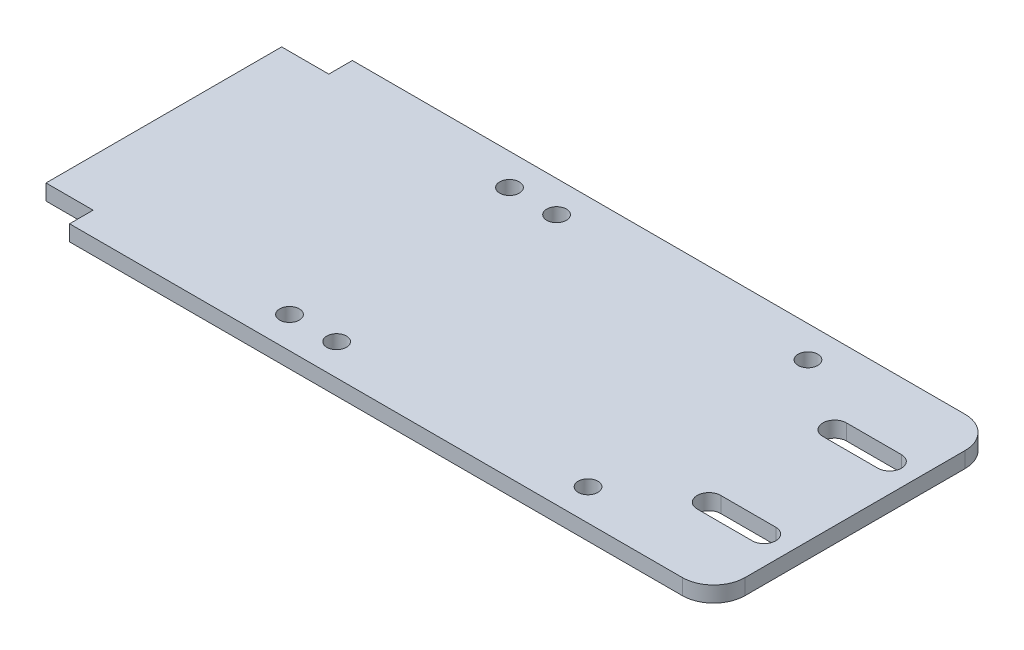
ISO-10303-21;
HEADER;
FILE_DESCRIPTION(('STEP AP214'),'2;1');
FILE_NAME('part.step','',(''),(''),'','','');
FILE_SCHEMA(('AUTOMOTIVE_DESIGN { 1 0 10303 214 1 1 1 1 }'));
ENDSEC;
DATA;
#1=APPLICATION_CONTEXT('core data for automotive mechanical design processes');
#2=APPLICATION_PROTOCOL_DEFINITION('international standard','automotive_design',2000,#1);
#3=PRODUCT_CONTEXT('',#1,'mechanical');
#4=PRODUCT('Part','Part','',(#3));
#5=PRODUCT_RELATED_PRODUCT_CATEGORY('part','',(#4));
#6=PRODUCT_DEFINITION_FORMATION('','',#4);
#7=PRODUCT_DEFINITION_CONTEXT('part definition',#1,'design');
#8=PRODUCT_DEFINITION('design','',#6,#7);
#9=PRODUCT_DEFINITION_SHAPE('','',#8);
#10=(LENGTH_UNIT() NAMED_UNIT(*) SI_UNIT(.MILLI.,.METRE.));
#11=(NAMED_UNIT(*) PLANE_ANGLE_UNIT() SI_UNIT($,.RADIAN.));
#12=(NAMED_UNIT(*) SI_UNIT($,.STERADIAN.) SOLID_ANGLE_UNIT());
#13=UNCERTAINTY_MEASURE_WITH_UNIT(LENGTH_MEASURE(1.E-05),#10,'distance_accuracy_value','');
#14=(GEOMETRIC_REPRESENTATION_CONTEXT(3) GLOBAL_UNCERTAINTY_ASSIGNED_CONTEXT((#13)) GLOBAL_UNIT_ASSIGNED_CONTEXT((#10,
#11,#12)) REPRESENTATION_CONTEXT('',''));
#15=CARTESIAN_POINT('',(0.,0.,0.));
#16=DIRECTION('',(0.,0.,1.));
#17=DIRECTION('',(1.,0.,0.));
#18=AXIS2_PLACEMENT_3D('',#15,#16,#17);
#19=CARTESIAN_POINT('',(0.,-10.0000000000001,0.));
#20=DIRECTION('',(0.,-1.,0.));
#21=DIRECTION('',(0.,0.,-1.));
#22=AXIS2_PLACEMENT_3D('',#19,#20,#21);
#23=PLANE('',#22);
#24=DIRECTION('',(0.,0.,-1.));
#25=VECTOR('',#24,1.);
#26=CARTESIAN_POINT('',(-190.,-9.99999999999973,-89.9999999999998));
#27=LINE('',#26,#25);
#28=CARTESIAN_POINT('',(-190.,-9.99999999999976,-74.9999999999998));
#29=VERTEX_POINT('',#28);
#30=CARTESIAN_POINT('',(-190.,-9.99999999999973,-89.9999999999998));
#31=VERTEX_POINT('',#30);
#32=EDGE_CURVE('E179',#29,#31,#27,.T.);
#33=ORIENTED_EDGE('',*,*,#32,.T.);
#34=DIRECTION('',(-1.,0.,0.));
#35=VECTOR('',#34,1.);
#36=CARTESIAN_POINT('',(-220.,-10.,-89.9999999999999));
#37=LINE('',#36,#35);
#38=CARTESIAN_POINT('',(200.,-10.,-89.9999999999999));
#39=VERTEX_POINT('',#38);
#40=EDGE_CURVE('E197',#39,#31,#37,.T.);
#41=ORIENTED_EDGE('',*,*,#40,.F.);
#42=CARTESIAN_POINT('',(200.,-9.99999999999991,-69.9999999999998));
#43=DIRECTION('',(0.,-1.,0.));
#44=DIRECTION('',(0.,0.,-1.));
#45=AXIS2_PLACEMENT_3D('',#42,#43,#44);
#46=CIRCLE('',#45,20.);
#47=CARTESIAN_POINT('',(220.,-9.99999999999993,-69.9999999999999));
#48=VERTEX_POINT('',#47);
#49=EDGE_CURVE('E51',#39,#48,#46,.T.);
#50=ORIENTED_EDGE('',*,*,#49,.T.);
#51=DIRECTION('',(0.,0.,-1.));
#52=VECTOR('',#51,1.);
#53=CARTESIAN_POINT('',(220.,-10.,90.0000000000002));
#54=LINE('',#53,#52);
#55=CARTESIAN_POINT('',(220.,-10.0000000000001,70.0000000000002));
#56=VERTEX_POINT('',#55);
#57=EDGE_CURVE('E205',#56,#48,#54,.T.);
#58=ORIENTED_EDGE('',*,*,#57,.F.);
#59=CARTESIAN_POINT('',(200.,-9.99999999999984,70.0000000000002));
#60=DIRECTION('',(0.,-1.,0.));
#61=DIRECTION('',(0.,0.,-1.));
#62=AXIS2_PLACEMENT_3D('',#59,#60,#61);
#63=CIRCLE('',#62,20.);
#64=CARTESIAN_POINT('',(200.,-10.,90.0000000000002));
#65=VERTEX_POINT('',#64);
#66=EDGE_CURVE('E238',#56,#65,#63,.T.);
#67=ORIENTED_EDGE('',*,*,#66,.T.);
#68=DIRECTION('',(1.,0.,0.));
#69=VECTOR('',#68,1.);
#70=CARTESIAN_POINT('',(-220.,-10.,90.0000000000002));
#71=LINE('',#70,#69);
#72=CARTESIAN_POINT('',(-190.,-9.99999999999988,90.0000000000001));
#73=VERTEX_POINT('',#72);
#74=EDGE_CURVE('E196',#73,#65,#71,.T.);
#75=ORIENTED_EDGE('',*,*,#74,.F.);
#76=DIRECTION('',(0.,0.,-1.));
#77=VECTOR('',#76,1.);
#78=CARTESIAN_POINT('',(-190.,-9.99999999999988,90.0000000000001));
#79=LINE('',#78,#77);
#80=CARTESIAN_POINT('',(-190.,-9.99999999999988,75.));
#81=VERTEX_POINT('',#80);
#82=EDGE_CURVE('E276',#73,#81,#79,.T.);
#83=ORIENTED_EDGE('',*,*,#82,.T.);
#84=DIRECTION('',(-1.,0.,0.));
#85=VECTOR('',#84,1.);
#86=CARTESIAN_POINT('',(-220.,-10.,75.0000000000002));
#87=LINE('',#86,#85);
#88=CARTESIAN_POINT('',(-220.,-10.,75.0000000000002));
#89=VERTEX_POINT('',#88);
#90=EDGE_CURVE('E194',#81,#89,#87,.T.);
#91=ORIENTED_EDGE('',*,*,#90,.T.);
#92=DIRECTION('',(0.,0.,1.));
#93=VECTOR('',#92,1.);
#94=CARTESIAN_POINT('',(-220.,-10.,90.0000000000002));
#95=LINE('',#94,#93);
#96=CARTESIAN_POINT('',(-220.,-10.,-74.9999999999999));
#97=VERTEX_POINT('',#96);
#98=EDGE_CURVE('E185',#97,#89,#95,.T.);
#99=ORIENTED_EDGE('',*,*,#98,.F.);
#100=DIRECTION('',(1.,0.,0.));
#101=VECTOR('',#100,1.);
#102=CARTESIAN_POINT('',(-220.,-10.,-74.9999999999999));
#103=LINE('',#102,#101);
#104=EDGE_CURVE('E167',#97,#29,#103,.T.);
#105=ORIENTED_EDGE('',*,*,#104,.T.);
#106=EDGE_LOOP('',(#33,#41,#50,#58,#67,#75,#83,#91,#99,#105));
#107=FACE_BOUND('',#106,.T.);
#108=CARTESIAN_POINT('',(167.,-9.99999999999995,40.0000000000004));
#109=DIRECTION('',(0.,-1.,0.));
#110=DIRECTION('',(0.,0.,-1.));
#111=AXIS2_PLACEMENT_3D('',#108,#109,#110);
#112=CIRCLE('',#111,7.5);
#113=CARTESIAN_POINT('',(167.,-9.99999999999993,32.5000000000001));
#114=VERTEX_POINT('',#113);
#115=CARTESIAN_POINT('',(167.,-9.99999999999993,47.5000000000004));
#116=VERTEX_POINT('',#115);
#117=EDGE_CURVE('E345',#114,#116,#112,.F.);
#118=ORIENTED_EDGE('',*,*,#117,.T.);
#119=DIRECTION('',(1.,0.,0.));
#120=VECTOR('',#119,1.);
#121=CARTESIAN_POINT('',(167.,-9.99999999999993,47.5000000000004));
#122=LINE('',#121,#120);
#123=CARTESIAN_POINT('',(202.,-9.99999999999986,47.5000000000004));
#124=VERTEX_POINT('',#123);
#125=EDGE_CURVE('E368',#116,#124,#122,.T.);
#126=ORIENTED_EDGE('',*,*,#125,.T.);
#127=CARTESIAN_POINT('',(202.,-9.99999999999987,40.0000000000004));
#128=DIRECTION('',(0.,-1.,0.));
#129=DIRECTION('',(0.,0.,-1.));
#130=AXIS2_PLACEMENT_3D('',#127,#128,#129);
#131=CIRCLE('',#130,7.5);
#132=CARTESIAN_POINT('',(202.,-9.99999999999987,32.5000000000001));
#133=VERTEX_POINT('',#132);
#134=EDGE_CURVE('E337',#124,#133,#131,.F.);
#135=ORIENTED_EDGE('',*,*,#134,.T.);
#136=DIRECTION('',(-1.,0.,0.));
#137=VECTOR('',#136,1.);
#138=CARTESIAN_POINT('',(167.,-9.99999999999993,32.5000000000001));
#139=LINE('',#138,#137);
#140=EDGE_CURVE('E341',#133,#114,#139,.T.);
#141=ORIENTED_EDGE('',*,*,#140,.T.);
#142=EDGE_LOOP('',(#118,#126,#135,#141));
#143=FACE_BOUND('',#142,.T.);
#144=CARTESIAN_POINT('',(-40.,-9.99999999999993,70.0000000000004));
#145=DIRECTION('',(0.,-1.,0.));
#146=DIRECTION('',(0.,0.,-1.));
#147=AXIS2_PLACEMENT_3D('',#144,#145,#146);
#148=CIRCLE('',#147,6.25000000000001);
#149=CARTESIAN_POINT('',(-40.,-9.99999999999993,63.7500000000004));
#150=VERTEX_POINT('',#149);
#151=EDGE_CURVE('E381',#150,#150,#148,.F.);
#152=ORIENTED_EDGE('',*,*,#151,.T.);
#153=EDGE_LOOP('',(#152));
#154=FACE_BOUND('',#153,.T.);
#155=CARTESIAN_POINT('',(-40.,-10.0000000000002,-69.9999999999998));
#156=DIRECTION('',(0.,-1.,0.));
#157=DIRECTION('',(0.,0.,-1.));
#158=AXIS2_PLACEMENT_3D('',#155,#156,#157);
#159=CIRCLE('',#158,6.25000000000001);
#160=CARTESIAN_POINT('',(-40.,-10.0000000000002,-76.2499999999998));
#161=VERTEX_POINT('',#160);
#162=EDGE_CURVE('E386',#161,#161,#159,.F.);
#163=ORIENTED_EDGE('',*,*,#162,.T.);
#164=EDGE_LOOP('',(#163));
#165=FACE_BOUND('',#164,.T.);
#166=CARTESIAN_POINT('',(-70.,-9.99999999999999,-69.9999999999998));
#167=DIRECTION('',(0.,-1.,0.));
#168=DIRECTION('',(0.,0.,-1.));
#169=AXIS2_PLACEMENT_3D('',#166,#167,#168);
#170=CIRCLE('',#169,6.25);
#171=CARTESIAN_POINT('',(-70.,-9.99999999999999,-76.2499999999998));
#172=VERTEX_POINT('',#171);
#173=EDGE_CURVE('E411',#172,#172,#170,.F.);
#174=ORIENTED_EDGE('',*,*,#173,.T.);
#175=EDGE_LOOP('',(#174));
#176=FACE_BOUND('',#175,.T.);
#177=CARTESIAN_POINT('',(120.,-9.99999999999983,70.0000000000002));
#178=DIRECTION('',(0.,-1.,0.));
#179=DIRECTION('',(0.,0.,-1.));
#180=AXIS2_PLACEMENT_3D('',#177,#178,#179);
#181=CIRCLE('',#180,6.25);
#182=CARTESIAN_POINT('',(120.,-9.99999999999983,63.7500000000002));
#183=VERTEX_POINT('',#182);
#184=EDGE_CURVE('E402',#183,#183,#181,.F.);
#185=ORIENTED_EDGE('',*,*,#184,.T.);
#186=EDGE_LOOP('',(#185));
#187=FACE_BOUND('',#186,.T.);
#188=CARTESIAN_POINT('',(-69.9999999999999,-9.99999999999984,70.0000000000003));
#189=DIRECTION('',(0.,-1.,0.));
#190=DIRECTION('',(0.,0.,-1.));
#191=AXIS2_PLACEMENT_3D('',#188,#189,#190);
#192=CIRCLE('',#191,6.25);
#193=CARTESIAN_POINT('',(-69.9999999999999,-9.99999999999984,63.7500000000002));
#194=VERTEX_POINT('',#193);
#195=EDGE_CURVE('E394',#194,#194,#192,.F.);
#196=ORIENTED_EDGE('',*,*,#195,.T.);
#197=EDGE_LOOP('',(#196));
#198=FACE_BOUND('',#197,.T.);
#199=CARTESIAN_POINT('',(120.,-9.99999999999987,-70.));
#200=DIRECTION('',(0.,-1.,0.));
#201=DIRECTION('',(0.,0.,-1.));
#202=AXIS2_PLACEMENT_3D('',#199,#200,#201);
#203=CIRCLE('',#202,6.25);
#204=CARTESIAN_POINT('',(120.,-9.99999999999987,-76.25));
#205=VERTEX_POINT('',#204);
#206=EDGE_CURVE('E410',#205,#205,#203,.F.);
#207=ORIENTED_EDGE('',*,*,#206,.T.);
#208=EDGE_LOOP('',(#207));
#209=FACE_BOUND('',#208,.T.);
#210=DIRECTION('',(1.,0.,0.));
#211=VECTOR('',#210,1.);
#212=CARTESIAN_POINT('',(167.,-10.0000000000001,-47.5));
#213=LINE('',#212,#211);
#214=CARTESIAN_POINT('',(167.,-10.0000000000001,-47.5));
#215=VERTEX_POINT('',#214);
#216=CARTESIAN_POINT('',(202.,-9.99999999999991,-47.5));
#217=VERTEX_POINT('',#216);
#218=EDGE_CURVE('E269',#215,#217,#213,.T.);
#219=ORIENTED_EDGE('',*,*,#218,.F.);
#220=CARTESIAN_POINT('',(167.,-10.,-40.));
#221=DIRECTION('',(0.,-1.,0.));
#222=DIRECTION('',(0.,0.,-1.));
#223=AXIS2_PLACEMENT_3D('',#220,#221,#222);
#224=CIRCLE('',#223,7.5);
#225=CARTESIAN_POINT('',(167.,-10.0000000000001,-32.5));
#226=VERTEX_POINT('',#225);
#227=EDGE_CURVE('E300',#226,#215,#224,.T.);
#228=ORIENTED_EDGE('',*,*,#227,.F.);
#229=DIRECTION('',(-1.,0.,0.));
#230=VECTOR('',#229,1.);
#231=CARTESIAN_POINT('',(167.,-10.0000000000001,-32.5));
#232=LINE('',#231,#230);
#233=CARTESIAN_POINT('',(202.,-9.9999999999998,-32.4999999999999));
#234=VERTEX_POINT('',#233);
#235=EDGE_CURVE('E324',#234,#226,#232,.T.);
#236=ORIENTED_EDGE('',*,*,#235,.F.);
#237=CARTESIAN_POINT('',(202.,-9.99999999999991,-40.));
#238=DIRECTION('',(0.,-1.,0.));
#239=DIRECTION('',(0.,0.,-1.));
#240=AXIS2_PLACEMENT_3D('',#237,#238,#239);
#241=CIRCLE('',#240,7.5);
#242=EDGE_CURVE('E265',#217,#234,#241,.T.);
#243=ORIENTED_EDGE('',*,*,#242,.F.);
#244=EDGE_LOOP('',(#219,#228,#236,#243));
#245=FACE_BOUND('',#244,.T.);
#246=ADVANCED_FACE('F42',(#107,#143,#154,#165,#176,#187,#198,#209,#245),#23,.T.);
#247=CARTESIAN_POINT('',(0.,0.,0.));
#248=DIRECTION('',(0.,-1.,0.));
#249=DIRECTION('',(0.,0.,-1.));
#250=AXIS2_PLACEMENT_3D('',#247,#248,#249);
#251=PLANE('',#250);
#252=DIRECTION('',(-1.,0.,0.));
#253=VECTOR('',#252,1.);
#254=CARTESIAN_POINT('',(-220.,0.,-89.9999999999999));
#255=LINE('',#254,#253);
#256=CARTESIAN_POINT('',(200.,0.,-89.9999999999998));
#257=VERTEX_POINT('',#256);
#258=CARTESIAN_POINT('',(-190.,0.,-89.9999999999999));
#259=VERTEX_POINT('',#258);
#260=EDGE_CURVE('E213',#257,#259,#255,.T.);
#261=ORIENTED_EDGE('',*,*,#260,.T.);
#262=DIRECTION('',(0.,0.,-1.));
#263=VECTOR('',#262,1.);
#264=CARTESIAN_POINT('',(-190.,0.,-89.9999999999999));
#265=LINE('',#264,#263);
#266=CARTESIAN_POINT('',(-190.,1.66533453693773E-13,-74.9999999999999));
#267=VERTEX_POINT('',#266);
#268=EDGE_CURVE('E66',#267,#259,#265,.T.);
#269=ORIENTED_EDGE('',*,*,#268,.F.);
#270=DIRECTION('',(1.,0.,0.));
#271=VECTOR('',#270,1.);
#272=CARTESIAN_POINT('',(-220.,1.66533453693773E-13,-74.9999999999999));
#273=LINE('',#272,#271);
#274=CARTESIAN_POINT('',(-220.,1.66533453693773E-13,-74.9999999999999));
#275=VERTEX_POINT('',#274);
#276=EDGE_CURVE('E291',#275,#267,#273,.T.);
#277=ORIENTED_EDGE('',*,*,#276,.F.);
#278=DIRECTION('',(0.,0.,1.));
#279=VECTOR('',#278,1.);
#280=CARTESIAN_POINT('',(-219.999999999999,0.,90.0000000000002));
#281=LINE('',#280,#279);
#282=CARTESIAN_POINT('',(-219.999999999999,0.,75.0000000000002));
#283=VERTEX_POINT('',#282);
#284=EDGE_CURVE('E187',#275,#283,#281,.T.);
#285=ORIENTED_EDGE('',*,*,#284,.T.);
#286=DIRECTION('',(-1.,0.,0.));
#287=VECTOR('',#286,1.);
#288=CARTESIAN_POINT('',(-219.999999999999,0.,75.0000000000002));
#289=LINE('',#288,#287);
#290=CARTESIAN_POINT('',(-190.,0.,75.0000000000002));
#291=VERTEX_POINT('',#290);
#292=EDGE_CURVE('E58',#291,#283,#289,.T.);
#293=ORIENTED_EDGE('',*,*,#292,.F.);
#294=DIRECTION('',(0.,0.,-1.));
#295=VECTOR('',#294,1.);
#296=CARTESIAN_POINT('',(-190.,0.,90.0000000000002));
#297=LINE('',#296,#295);
#298=CARTESIAN_POINT('',(-190.,0.,90.0000000000002));
#299=VERTEX_POINT('',#298);
#300=EDGE_CURVE('E282',#299,#291,#297,.T.);
#301=ORIENTED_EDGE('',*,*,#300,.F.);
#302=DIRECTION('',(1.,0.,0.));
#303=VECTOR('',#302,1.);
#304=CARTESIAN_POINT('',(-219.999999999999,0.,90.0000000000002));
#305=LINE('',#304,#303);
#306=CARTESIAN_POINT('',(200.,0.,90.0000000000002));
#307=VERTEX_POINT('',#306);
#308=EDGE_CURVE('E220',#299,#307,#305,.T.);
#309=ORIENTED_EDGE('',*,*,#308,.T.);
#310=CARTESIAN_POINT('',(200.,0.,70.0000000000002));
#311=DIRECTION('',(0.,-1.,0.));
#312=DIRECTION('',(0.,0.,-1.));
#313=AXIS2_PLACEMENT_3D('',#310,#311,#312);
#314=CIRCLE('',#313,20.);
#315=CARTESIAN_POINT('',(220.,0.,70.0000000000002));
#316=VERTEX_POINT('',#315);
#317=EDGE_CURVE('E229',#307,#316,#314,.F.);
#318=ORIENTED_EDGE('',*,*,#317,.T.);
#319=DIRECTION('',(0.,0.,-1.));
#320=VECTOR('',#319,1.);
#321=CARTESIAN_POINT('',(220.,0.,90.0000000000002));
#322=LINE('',#321,#320);
#323=CARTESIAN_POINT('',(220.,0.,-69.9999999999999));
#324=VERTEX_POINT('',#323);
#325=EDGE_CURVE('E209',#316,#324,#322,.T.);
#326=ORIENTED_EDGE('',*,*,#325,.T.);
#327=CARTESIAN_POINT('',(200.,0.,-69.9999999999998));
#328=DIRECTION('',(0.,-1.,0.));
#329=DIRECTION('',(0.,0.,-1.));
#330=AXIS2_PLACEMENT_3D('',#327,#328,#329);
#331=CIRCLE('',#330,20.);
#332=EDGE_CURVE('E232',#324,#257,#331,.F.);
#333=ORIENTED_EDGE('',*,*,#332,.T.);
#334=EDGE_LOOP('',(#261,#269,#277,#285,#293,#301,#309,#318,#326,#333));
#335=FACE_BOUND('',#334,.T.);
#336=CARTESIAN_POINT('',(120.,-1.80411241501588E-13,-70.));
#337=DIRECTION('',(0.,1.,0.));
#338=DIRECTION('',(0.,0.,1.));
#339=AXIS2_PLACEMENT_3D('',#336,#337,#338);
#340=CIRCLE('',#339,6.25);
#341=CARTESIAN_POINT('',(120.,-1.80411241501588E-13,-63.7499999999999));
#342=VERTEX_POINT('',#341);
#343=EDGE_CURVE('E214',#342,#342,#340,.T.);
#344=ORIENTED_EDGE('',*,*,#343,.F.);
#345=EDGE_LOOP('',(#344));
#346=FACE_BOUND('',#345,.T.);
#347=CARTESIAN_POINT('',(-70.,1.11022302462516E-13,70.0000000000003));
#348=DIRECTION('',(0.,1.,0.));
#349=DIRECTION('',(0.,0.,1.));
#350=AXIS2_PLACEMENT_3D('',#347,#348,#349);
#351=CIRCLE('',#350,6.25);
#352=CARTESIAN_POINT('',(-70.,1.11022302462516E-13,76.2500000000003));
#353=VERTEX_POINT('',#352);
#354=EDGE_CURVE('E398',#353,#353,#351,.T.);
#355=ORIENTED_EDGE('',*,*,#354,.F.);
#356=EDGE_LOOP('',(#355));
#357=FACE_BOUND('',#356,.T.);
#358=CARTESIAN_POINT('',(120.,0.,70.0000000000002));
#359=DIRECTION('',(0.,1.,0.));
#360=DIRECTION('',(0.,0.,1.));
#361=AXIS2_PLACEMENT_3D('',#358,#359,#360);
#362=CIRCLE('',#361,6.25);
#363=CARTESIAN_POINT('',(120.,0.,76.2500000000002));
#364=VERTEX_POINT('',#363);
#365=EDGE_CURVE('E415',#364,#364,#362,.T.);
#366=ORIENTED_EDGE('',*,*,#365,.F.);
#367=EDGE_LOOP('',(#366));
#368=FACE_BOUND('',#367,.T.);
#369=CARTESIAN_POINT('',(-70.,0.,-70.));
#370=DIRECTION('',(0.,1.,0.));
#371=DIRECTION('',(0.,0.,1.));
#372=AXIS2_PLACEMENT_3D('',#369,#370,#371);
#373=CIRCLE('',#372,6.25);
#374=CARTESIAN_POINT('',(-70.,0.,-63.7499999999999));
#375=VERTEX_POINT('',#374);
#376=EDGE_CURVE('E406',#375,#375,#373,.T.);
#377=ORIENTED_EDGE('',*,*,#376,.F.);
#378=EDGE_LOOP('',(#377));
#379=FACE_BOUND('',#378,.T.);
#380=CARTESIAN_POINT('',(-39.9999999999999,1.11022302462516E-13,-69.9999999999998));
#381=DIRECTION('',(0.,1.,0.));
#382=DIRECTION('',(0.,0.,1.));
#383=AXIS2_PLACEMENT_3D('',#380,#381,#382);
#384=CIRCLE('',#383,6.25000000000001);
#385=CARTESIAN_POINT('',(-39.9999999999999,1.11022302462516E-13,-63.7499999999998));
#386=VERTEX_POINT('',#385);
#387=EDGE_CURVE('E390',#386,#386,#384,.T.);
#388=ORIENTED_EDGE('',*,*,#387,.F.);
#389=EDGE_LOOP('',(#388));
#390=FACE_BOUND('',#389,.T.);
#391=CARTESIAN_POINT('',(-39.9999999999999,1.80411241501588E-13,70.0000000000004));
#392=DIRECTION('',(0.,1.,0.));
#393=DIRECTION('',(0.,0.,1.));
#394=AXIS2_PLACEMENT_3D('',#391,#392,#393);
#395=CIRCLE('',#394,6.25000000000001);
#396=CARTESIAN_POINT('',(-39.9999999999999,1.80411241501588E-13,76.2500000000004));
#397=VERTEX_POINT('',#396);
#398=EDGE_CURVE('E382',#397,#397,#395,.T.);
#399=ORIENTED_EDGE('',*,*,#398,.F.);
#400=EDGE_LOOP('',(#399));
#401=FACE_BOUND('',#400,.T.);
#402=DIRECTION('',(1.,0.,0.));
#403=VECTOR('',#402,1.);
#404=CARTESIAN_POINT('',(167.,0.,47.5000000000003));
#405=LINE('',#404,#403);
#406=CARTESIAN_POINT('',(167.,0.,47.5000000000003));
#407=VERTEX_POINT('',#406);
#408=CARTESIAN_POINT('',(202.,0.,47.5000000000001));
#409=VERTEX_POINT('',#408);
#410=EDGE_CURVE('E352',#407,#409,#405,.T.);
#411=ORIENTED_EDGE('',*,*,#410,.F.);
#412=CARTESIAN_POINT('',(167.,0.,40.0000000000003));
#413=DIRECTION('',(0.,1.,0.));
#414=DIRECTION('',(0.,0.,1.));
#415=AXIS2_PLACEMENT_3D('',#412,#413,#414);
#416=CIRCLE('',#415,7.5);
#417=CARTESIAN_POINT('',(167.,0.,32.5000000000001));
#418=VERTEX_POINT('',#417);
#419=EDGE_CURVE('E349',#418,#407,#416,.T.);
#420=ORIENTED_EDGE('',*,*,#419,.F.);
#421=DIRECTION('',(-1.,0.,0.));
#422=VECTOR('',#421,1.);
#423=CARTESIAN_POINT('',(167.,0.,32.5000000000001));
#424=LINE('',#423,#422);
#425=CARTESIAN_POINT('',(202.,1.66533453693773E-13,32.5000000000001));
#426=VERTEX_POINT('',#425);
#427=EDGE_CURVE('E360',#426,#418,#424,.T.);
#428=ORIENTED_EDGE('',*,*,#427,.F.);
#429=CARTESIAN_POINT('',(202.,2.08166817117217E-13,40.0000000000001));
#430=DIRECTION('',(0.,1.,0.));
#431=DIRECTION('',(0.,0.,1.));
#432=AXIS2_PLACEMENT_3D('',#429,#430,#431);
#433=CIRCLE('',#432,7.5);
#434=EDGE_CURVE('E356',#409,#426,#433,.T.);
#435=ORIENTED_EDGE('',*,*,#434,.F.);
#436=EDGE_LOOP('',(#411,#420,#428,#435));
#437=FACE_BOUND('',#436,.T.);
#438=CARTESIAN_POINT('',(167.,0.,-40.));
#439=DIRECTION('',(0.,-1.,0.));
#440=DIRECTION('',(0.,0.,-1.));
#441=AXIS2_PLACEMENT_3D('',#438,#439,#440);
#442=CIRCLE('',#441,7.5);
#443=CARTESIAN_POINT('',(167.,0.,-32.5));
#444=VERTEX_POINT('',#443);
#445=CARTESIAN_POINT('',(167.,0.,-47.5));
#446=VERTEX_POINT('',#445);
#447=EDGE_CURVE('E304',#444,#446,#442,.T.);
#448=ORIENTED_EDGE('',*,*,#447,.T.);
#449=DIRECTION('',(1.,0.,0.));
#450=VECTOR('',#449,1.);
#451=CARTESIAN_POINT('',(167.,0.,-47.5));
#452=LINE('',#451,#450);
#453=CARTESIAN_POINT('',(202.,0.,-47.4999999999999));
#454=VERTEX_POINT('',#453);
#455=EDGE_CURVE('E316',#446,#454,#452,.T.);
#456=ORIENTED_EDGE('',*,*,#455,.T.);
#457=CARTESIAN_POINT('',(202.,0.,-39.9999999999999));
#458=DIRECTION('',(0.,-1.,0.));
#459=DIRECTION('',(0.,0.,-1.));
#460=AXIS2_PLACEMENT_3D('',#457,#458,#459);
#461=CIRCLE('',#460,7.5);
#462=CARTESIAN_POINT('',(202.,1.11022302462516E-13,-32.4999999999999));
#463=VERTEX_POINT('',#462);
#464=EDGE_CURVE('E312',#454,#463,#461,.T.);
#465=ORIENTED_EDGE('',*,*,#464,.T.);
#466=DIRECTION('',(-1.,0.,0.));
#467=VECTOR('',#466,1.);
#468=CARTESIAN_POINT('',(167.,0.,-32.5));
#469=LINE('',#468,#467);
#470=EDGE_CURVE('E308',#463,#444,#469,.T.);
#471=ORIENTED_EDGE('',*,*,#470,.T.);
#472=EDGE_LOOP('',(#448,#456,#465,#471));
#473=FACE_BOUND('',#472,.T.);
#474=ADVANCED_FACE('F259',(#335,#346,#357,#368,#379,#390,#401,#437,#473),#251,.F.);
#475=CARTESIAN_POINT('',(220.,-10.,90.0000000000002));
#476=DIRECTION('',(1.,0.,0.));
#477=DIRECTION('',(0.,0.,-1.));
#478=AXIS2_PLACEMENT_3D('',#475,#476,#477);
#479=PLANE('',#478);
#480=ORIENTED_EDGE('',*,*,#57,.T.);
#481=DIRECTION('',(0.,1.,0.));
#482=VECTOR('',#481,1.);
#483=CARTESIAN_POINT('',(220.,-9.99999999999993,-69.9999999999999));
#484=LINE('',#483,#482);
#485=EDGE_CURVE('E225',#48,#324,#484,.T.);
#486=ORIENTED_EDGE('',*,*,#485,.T.);
#487=ORIENTED_EDGE('',*,*,#325,.F.);
#488=DIRECTION('',(0.,1.,0.));
#489=VECTOR('',#488,1.);
#490=CARTESIAN_POINT('',(220.,-10.0000000000001,70.0000000000002));
#491=LINE('',#490,#489);
#492=EDGE_CURVE('E201',#316,#56,#491,.F.);
#493=ORIENTED_EDGE('',*,*,#492,.T.);
#494=EDGE_LOOP('',(#480,#486,#487,#493));
#495=FACE_BOUND('',#494,.T.);
#496=ADVANCED_FACE('F253',(#495),#479,.T.);
#497=CARTESIAN_POINT('',(-220.,-10.,90.0000000000002));
#498=DIRECTION('',(0.,0.,1.));
#499=DIRECTION('',(1.,0.,0.));
#500=AXIS2_PLACEMENT_3D('',#497,#498,#499);
#501=PLANE('',#500);
#502=DIRECTION('',(0.,1.,0.));
#503=VECTOR('',#502,1.);
#504=CARTESIAN_POINT('',(-190.,-9.99999999999988,90.0000000000001));
#505=LINE('',#504,#503);
#506=EDGE_CURVE('E281',#73,#299,#505,.T.);
#507=ORIENTED_EDGE('',*,*,#506,.F.);
#508=ORIENTED_EDGE('',*,*,#74,.T.);
#509=DIRECTION('',(0.,1.,0.));
#510=VECTOR('',#509,1.);
#511=CARTESIAN_POINT('',(200.,-10.,90.0000000000002));
#512=LINE('',#511,#510);
#513=EDGE_CURVE('E11',#65,#307,#512,.T.);
#514=ORIENTED_EDGE('',*,*,#513,.T.);
#515=ORIENTED_EDGE('',*,*,#308,.F.);
#516=EDGE_LOOP('',(#507,#508,#514,#515));
#517=FACE_BOUND('',#516,.T.);
#518=ADVANCED_FACE('F486',(#517),#501,.T.);
#519=CARTESIAN_POINT('',(-220.,-10.,90.0000000000002));
#520=DIRECTION('',(-1.,0.,0.));
#521=DIRECTION('',(0.,0.,1.));
#522=AXIS2_PLACEMENT_3D('',#519,#520,#521);
#523=PLANE('',#522);
#524=DIRECTION('',(0.,1.,0.));
#525=VECTOR('',#524,1.);
#526=CARTESIAN_POINT('',(-220.,-10.,-74.9999999999999));
#527=LINE('',#526,#525);
#528=EDGE_CURVE('E171',#97,#275,#527,.T.);
#529=ORIENTED_EDGE('',*,*,#528,.F.);
#530=ORIENTED_EDGE('',*,*,#98,.T.);
#531=DIRECTION('',(0.,1.,0.));
#532=VECTOR('',#531,1.);
#533=CARTESIAN_POINT('',(-220.,-10.,75.0000000000002));
#534=LINE('',#533,#532);
#535=EDGE_CURVE('E288',#89,#283,#534,.T.);
#536=ORIENTED_EDGE('',*,*,#535,.T.);
#537=ORIENTED_EDGE('',*,*,#284,.F.);
#538=EDGE_LOOP('',(#529,#530,#536,#537));
#539=FACE_BOUND('',#538,.T.);
#540=ADVANCED_FACE('F184',(#539),#523,.T.);
#541=CARTESIAN_POINT('',(-220.,-10.,-89.9999999999999));
#542=DIRECTION('',(0.,0.,-1.));
#543=DIRECTION('',(-1.,0.,0.));
#544=AXIS2_PLACEMENT_3D('',#541,#542,#543);
#545=PLANE('',#544);
#546=DIRECTION('',(0.,1.,0.));
#547=VECTOR('',#546,1.);
#548=CARTESIAN_POINT('',(-190.,-9.99999999999973,-89.9999999999998));
#549=LINE('',#548,#547);
#550=EDGE_CURVE('E263',#31,#259,#549,.T.);
#551=ORIENTED_EDGE('',*,*,#550,.T.);
#552=ORIENTED_EDGE('',*,*,#260,.F.);
#553=DIRECTION('',(0.,1.,0.));
#554=VECTOR('',#553,1.);
#555=CARTESIAN_POINT('',(200.,-10.,-89.9999999999999));
#556=LINE('',#555,#554);
#557=EDGE_CURVE('E235',#257,#39,#556,.F.);
#558=ORIENTED_EDGE('',*,*,#557,.T.);
#559=ORIENTED_EDGE('',*,*,#40,.T.);
#560=EDGE_LOOP('',(#551,#552,#558,#559));
#561=FACE_BOUND('',#560,.T.);
#562=ADVANCED_FACE('F262',(#561),#545,.T.);
#563=CARTESIAN_POINT('',(120.,-10.0009999999999,-70.));
#564=DIRECTION('',(0.,1.,0.));
#565=DIRECTION('',(0.,0.,1.));
#566=AXIS2_PLACEMENT_3D('',#563,#564,#565);
#567=CYLINDRICAL_SURFACE('',#566,6.25);
#568=ORIENTED_EDGE('',*,*,#206,.F.);
#569=EDGE_LOOP('',(#568));
#570=FACE_BOUND('',#569,.T.);
#571=ORIENTED_EDGE('',*,*,#343,.T.);
#572=EDGE_LOOP('',(#571));
#573=FACE_BOUND('',#572,.T.);
#574=ADVANCED_FACE('F433',(#570,#573),#567,.F.);
#575=CARTESIAN_POINT('',(-70.,-10.0009999999998,70.0000000000003));
#576=DIRECTION('',(0.,1.,0.));
#577=DIRECTION('',(0.,0.,1.));
#578=AXIS2_PLACEMENT_3D('',#575,#576,#577);
#579=CYLINDRICAL_SURFACE('',#578,6.25);
#580=ORIENTED_EDGE('',*,*,#195,.F.);
#581=EDGE_LOOP('',(#580));
#582=FACE_BOUND('',#581,.T.);
#583=ORIENTED_EDGE('',*,*,#354,.T.);
#584=EDGE_LOOP('',(#583));
#585=FACE_BOUND('',#584,.T.);
#586=ADVANCED_FACE('F436',(#582,#585),#579,.F.);
#587=CARTESIAN_POINT('',(120.,-10.0009999999998,70.0000000000002));
#588=DIRECTION('',(0.,1.,0.));
#589=DIRECTION('',(0.,0.,1.));
#590=AXIS2_PLACEMENT_3D('',#587,#588,#589);
#591=CYLINDRICAL_SURFACE('',#590,6.25);
#592=ORIENTED_EDGE('',*,*,#184,.F.);
#593=EDGE_LOOP('',(#592));
#594=FACE_BOUND('',#593,.T.);
#595=ORIENTED_EDGE('',*,*,#365,.T.);
#596=EDGE_LOOP('',(#595));
#597=FACE_BOUND('',#596,.T.);
#598=ADVANCED_FACE('F655',(#594,#597),#591,.F.);
#599=CARTESIAN_POINT('',(-70.,-10.0009999999999,-69.9999999999998));
#600=DIRECTION('',(0.,1.,0.));
#601=DIRECTION('',(0.,0.,1.));
#602=AXIS2_PLACEMENT_3D('',#599,#600,#601);
#603=CYLINDRICAL_SURFACE('',#602,6.25);
#604=ORIENTED_EDGE('',*,*,#173,.F.);
#605=EDGE_LOOP('',(#604));
#606=FACE_BOUND('',#605,.T.);
#607=ORIENTED_EDGE('',*,*,#376,.T.);
#608=EDGE_LOOP('',(#607));
#609=FACE_BOUND('',#608,.T.);
#610=ADVANCED_FACE('F644',(#606,#609),#603,.F.);
#611=CARTESIAN_POINT('',(-40.,-10.001,-69.9999999999998));
#612=DIRECTION('',(0.,1.,0.));
#613=DIRECTION('',(0.,0.,1.));
#614=AXIS2_PLACEMENT_3D('',#611,#612,#613);
#615=CYLINDRICAL_SURFACE('',#614,6.25000000000001);
#616=ORIENTED_EDGE('',*,*,#162,.F.);
#617=EDGE_LOOP('',(#616));
#618=FACE_BOUND('',#617,.T.);
#619=ORIENTED_EDGE('',*,*,#387,.T.);
#620=EDGE_LOOP('',(#619));
#621=FACE_BOUND('',#620,.T.);
#622=ADVANCED_FACE('F633',(#618,#621),#615,.F.);
#623=CARTESIAN_POINT('',(-40.,-10.0009999999998,70.0000000000004));
#624=DIRECTION('',(0.,1.,0.));
#625=DIRECTION('',(0.,0.,1.));
#626=AXIS2_PLACEMENT_3D('',#623,#624,#625);
#627=CYLINDRICAL_SURFACE('',#626,6.25000000000001);
#628=ORIENTED_EDGE('',*,*,#151,.F.);
#629=EDGE_LOOP('',(#628));
#630=FACE_BOUND('',#629,.T.);
#631=ORIENTED_EDGE('',*,*,#398,.T.);
#632=EDGE_LOOP('',(#631));
#633=FACE_BOUND('',#632,.T.);
#634=ADVANCED_FACE('F622',(#630,#633),#627,.F.);
#635=CARTESIAN_POINT('',(167.,-10.0009999999999,40.0000000000004));
#636=DIRECTION('',(0.,1.,0.));
#637=DIRECTION('',(0.,0.,1.));
#638=AXIS2_PLACEMENT_3D('',#635,#636,#637);
#639=CYLINDRICAL_SURFACE('',#638,7.5);
#640=DIRECTION('',(0.,1.,0.));
#641=VECTOR('',#640,1.);
#642=CARTESIAN_POINT('',(167.,-10.0009999999999,32.5000000000001));
#643=LINE('',#642,#641);
#644=EDGE_CURVE('E365',#114,#418,#643,.T.);
#645=ORIENTED_EDGE('',*,*,#644,.T.);
#646=ORIENTED_EDGE('',*,*,#419,.T.);
#647=DIRECTION('',(0.,1.,0.));
#648=VECTOR('',#647,1.);
#649=CARTESIAN_POINT('',(167.,-10.0009999999999,47.5000000000004));
#650=LINE('',#649,#648);
#651=EDGE_CURVE('E364',#116,#407,#650,.T.);
#652=ORIENTED_EDGE('',*,*,#651,.F.);
#653=ORIENTED_EDGE('',*,*,#117,.F.);
#654=EDGE_LOOP('',(#645,#646,#652,#653));
#655=FACE_BOUND('',#654,.T.);
#656=ADVANCED_FACE('F611',(#655),#639,.F.);
#657=CARTESIAN_POINT('',(167.,-10.0009999999999,32.5000000000001));
#658=DIRECTION('',(0.,0.,-1.));
#659=DIRECTION('',(-1.,0.,0.));
#660=AXIS2_PLACEMENT_3D('',#657,#658,#659);
#661=PLANE('',#660);
#662=DIRECTION('',(0.,1.,0.));
#663=VECTOR('',#662,1.);
#664=CARTESIAN_POINT('',(202.,-10.001,32.5000000000001));
#665=LINE('',#664,#663);
#666=EDGE_CURVE('E369',#133,#426,#665,.T.);
#667=ORIENTED_EDGE('',*,*,#666,.T.);
#668=ORIENTED_EDGE('',*,*,#427,.T.);
#669=ORIENTED_EDGE('',*,*,#644,.F.);
#670=ORIENTED_EDGE('',*,*,#140,.F.);
#671=EDGE_LOOP('',(#667,#668,#669,#670));
#672=FACE_BOUND('',#671,.T.);
#673=ADVANCED_FACE('F600',(#672),#661,.F.);
#674=CARTESIAN_POINT('',(202.,-10.001,40.0000000000004));
#675=DIRECTION('',(0.,1.,0.));
#676=DIRECTION('',(0.,0.,1.));
#677=AXIS2_PLACEMENT_3D('',#674,#675,#676);
#678=CYLINDRICAL_SURFACE('',#677,7.5);
#679=DIRECTION('',(0.,1.,0.));
#680=VECTOR('',#679,1.);
#681=CARTESIAN_POINT('',(202.,-10.001,47.5000000000004));
#682=LINE('',#681,#680);
#683=EDGE_CURVE('E372',#124,#409,#682,.T.);
#684=ORIENTED_EDGE('',*,*,#683,.T.);
#685=ORIENTED_EDGE('',*,*,#434,.T.);
#686=ORIENTED_EDGE('',*,*,#666,.F.);
#687=ORIENTED_EDGE('',*,*,#134,.F.);
#688=EDGE_LOOP('',(#684,#685,#686,#687));
#689=FACE_BOUND('',#688,.T.);
#690=ADVANCED_FACE('F589',(#689),#678,.F.);
#691=CARTESIAN_POINT('',(167.,-10.0009999999999,47.5000000000004));
#692=DIRECTION('',(0.,0.,1.));
#693=DIRECTION('',(1.,0.,0.));
#694=AXIS2_PLACEMENT_3D('',#691,#692,#693);
#695=PLANE('',#694);
#696=ORIENTED_EDGE('',*,*,#651,.T.);
#697=ORIENTED_EDGE('',*,*,#410,.T.);
#698=ORIENTED_EDGE('',*,*,#683,.F.);
#699=ORIENTED_EDGE('',*,*,#125,.F.);
#700=EDGE_LOOP('',(#696,#697,#698,#699));
#701=FACE_BOUND('',#700,.T.);
#702=ADVANCED_FACE('F579',(#701),#695,.F.);
#703=CARTESIAN_POINT('',(167.,-10.001,-40.));
#704=DIRECTION('',(0.,1.,0.));
#705=DIRECTION('',(0.,0.,1.));
#706=AXIS2_PLACEMENT_3D('',#703,#704,#705);
#707=CYLINDRICAL_SURFACE('',#706,7.5);
#708=ORIENTED_EDGE('',*,*,#227,.T.);
#709=DIRECTION('',(0.,1.,0.));
#710=VECTOR('',#709,1.);
#711=CARTESIAN_POINT('',(167.,-10.0010000000001,-47.5));
#712=LINE('',#711,#710);
#713=EDGE_CURVE('E321',#215,#446,#712,.T.);
#714=ORIENTED_EDGE('',*,*,#713,.T.);
#715=ORIENTED_EDGE('',*,*,#447,.F.);
#716=DIRECTION('',(0.,1.,0.));
#717=VECTOR('',#716,1.);
#718=CARTESIAN_POINT('',(167.,-10.0010000000001,-32.5));
#719=LINE('',#718,#717);
#720=EDGE_CURVE('E320',#226,#444,#719,.T.);
#721=ORIENTED_EDGE('',*,*,#720,.F.);
#722=EDGE_LOOP('',(#708,#714,#715,#721));
#723=FACE_BOUND('',#722,.T.);
#724=ADVANCED_FACE('F459',(#723),#707,.F.);
#725=CARTESIAN_POINT('',(167.,-10.0010000000001,-47.5));
#726=DIRECTION('',(0.,0.,1.));
#727=DIRECTION('',(1.,0.,0.));
#728=AXIS2_PLACEMENT_3D('',#725,#726,#727);
#729=PLANE('',#728);
#730=ORIENTED_EDGE('',*,*,#218,.T.);
#731=DIRECTION('',(0.,1.,0.));
#732=VECTOR('',#731,1.);
#733=CARTESIAN_POINT('',(202.,-10.001,-47.5));
#734=LINE('',#733,#732);
#735=EDGE_CURVE('E325',#217,#454,#734,.T.);
#736=ORIENTED_EDGE('',*,*,#735,.T.);
#737=ORIENTED_EDGE('',*,*,#455,.F.);
#738=ORIENTED_EDGE('',*,*,#713,.F.);
#739=EDGE_LOOP('',(#730,#736,#737,#738));
#740=FACE_BOUND('',#739,.T.);
#741=ADVANCED_FACE('F468',(#740),#729,.T.);
#742=CARTESIAN_POINT('',(202.,-10.001,-40.));
#743=DIRECTION('',(0.,1.,0.));
#744=DIRECTION('',(0.,0.,1.));
#745=AXIS2_PLACEMENT_3D('',#742,#743,#744);
#746=CYLINDRICAL_SURFACE('',#745,7.5);
#747=ORIENTED_EDGE('',*,*,#242,.T.);
#748=DIRECTION('',(0.,1.,0.));
#749=VECTOR('',#748,1.);
#750=CARTESIAN_POINT('',(202.,-10.001,-32.4999999999999));
#751=LINE('',#750,#749);
#752=EDGE_CURVE('E328',#234,#463,#751,.T.);
#753=ORIENTED_EDGE('',*,*,#752,.T.);
#754=ORIENTED_EDGE('',*,*,#464,.F.);
#755=ORIENTED_EDGE('',*,*,#735,.F.);
#756=EDGE_LOOP('',(#747,#753,#754,#755));
#757=FACE_BOUND('',#756,.T.);
#758=ADVANCED_FACE('F471',(#757),#746,.F.);
#759=CARTESIAN_POINT('',(167.,-10.0010000000001,-32.5));
#760=DIRECTION('',(0.,0.,-1.));
#761=DIRECTION('',(-1.,0.,0.));
#762=AXIS2_PLACEMENT_3D('',#759,#760,#761);
#763=PLANE('',#762);
#764=ORIENTED_EDGE('',*,*,#235,.T.);
#765=ORIENTED_EDGE('',*,*,#720,.T.);
#766=ORIENTED_EDGE('',*,*,#470,.F.);
#767=ORIENTED_EDGE('',*,*,#752,.F.);
#768=EDGE_LOOP('',(#764,#765,#766,#767));
#769=FACE_BOUND('',#768,.T.);
#770=ADVANCED_FACE('F461',(#769),#763,.T.);
#771=CARTESIAN_POINT('',(200.,-9.99999999999991,-69.9999999999998));
#772=DIRECTION('',(0.,1.,0.));
#773=DIRECTION('',(0.,0.,1.));
#774=AXIS2_PLACEMENT_3D('',#771,#772,#773);
#775=CYLINDRICAL_SURFACE('',#774,20.);
#776=ORIENTED_EDGE('',*,*,#49,.F.);
#777=ORIENTED_EDGE('',*,*,#557,.F.);
#778=ORIENTED_EDGE('',*,*,#332,.F.);
#779=ORIENTED_EDGE('',*,*,#485,.F.);
#780=EDGE_LOOP('',(#776,#777,#778,#779));
#781=FACE_BOUND('',#780,.T.);
#782=ADVANCED_FACE('F256',(#781),#775,.T.);
#783=CARTESIAN_POINT('',(200.,-9.99999999999984,70.0000000000002));
#784=DIRECTION('',(0.,1.,0.));
#785=DIRECTION('',(0.,0.,1.));
#786=AXIS2_PLACEMENT_3D('',#783,#784,#785);
#787=CYLINDRICAL_SURFACE('',#786,20.);
#788=ORIENTED_EDGE('',*,*,#66,.F.);
#789=ORIENTED_EDGE('',*,*,#492,.F.);
#790=ORIENTED_EDGE('',*,*,#317,.F.);
#791=ORIENTED_EDGE('',*,*,#513,.F.);
#792=EDGE_LOOP('',(#788,#789,#790,#791));
#793=FACE_BOUND('',#792,.T.);
#794=ADVANCED_FACE('F44',(#793),#787,.T.);
#795=CARTESIAN_POINT('',(-190.,-9.99999999999973,-89.9999999999998));
#796=DIRECTION('',(1.,0.,0.));
#797=DIRECTION('',(0.,0.,-1.));
#798=AXIS2_PLACEMENT_3D('',#795,#796,#797);
#799=PLANE('',#798);
#800=ORIENTED_EDGE('',*,*,#268,.T.);
#801=ORIENTED_EDGE('',*,*,#550,.F.);
#802=ORIENTED_EDGE('',*,*,#32,.F.);
#803=DIRECTION('',(0.,1.,0.));
#804=VECTOR('',#803,1.);
#805=CARTESIAN_POINT('',(-190.,-9.99999999999976,-74.9999999999998));
#806=LINE('',#805,#804);
#807=EDGE_CURVE('E173',#29,#267,#806,.T.);
#808=ORIENTED_EDGE('',*,*,#807,.T.);
#809=EDGE_LOOP('',(#800,#801,#802,#808));
#810=FACE_BOUND('',#809,.T.);
#811=ADVANCED_FACE('F499',(#810),#799,.F.);
#812=CARTESIAN_POINT('',(-220.,-10.,-74.9999999999999));
#813=DIRECTION('',(0.,0.,1.));
#814=DIRECTION('',(1.,0.,0.));
#815=AXIS2_PLACEMENT_3D('',#812,#813,#814);
#816=PLANE('',#815);
#817=ORIENTED_EDGE('',*,*,#276,.T.);
#818=ORIENTED_EDGE('',*,*,#807,.F.);
#819=ORIENTED_EDGE('',*,*,#104,.F.);
#820=ORIENTED_EDGE('',*,*,#528,.T.);
#821=EDGE_LOOP('',(#817,#818,#819,#820));
#822=FACE_BOUND('',#821,.T.);
#823=ADVANCED_FACE('F170',(#822),#816,.F.);
#824=CARTESIAN_POINT('',(-220.,-10.,75.0000000000002));
#825=DIRECTION('',(0.,0.,-1.));
#826=DIRECTION('',(-1.,0.,0.));
#827=AXIS2_PLACEMENT_3D('',#824,#825,#826);
#828=PLANE('',#827);
#829=ORIENTED_EDGE('',*,*,#292,.T.);
#830=ORIENTED_EDGE('',*,*,#535,.F.);
#831=ORIENTED_EDGE('',*,*,#90,.F.);
#832=DIRECTION('',(0.,1.,0.));
#833=VECTOR('',#832,1.);
#834=CARTESIAN_POINT('',(-190.,-9.99999999999988,75.));
#835=LINE('',#834,#833);
#836=EDGE_CURVE('E292',#81,#291,#835,.T.);
#837=ORIENTED_EDGE('',*,*,#836,.T.);
#838=EDGE_LOOP('',(#829,#830,#831,#837));
#839=FACE_BOUND('',#838,.T.);
#840=ADVANCED_FACE('F519',(#839),#828,.F.);
#841=CARTESIAN_POINT('',(-190.,-9.99999999999988,90.0000000000001));
#842=DIRECTION('',(1.,0.,0.));
#843=DIRECTION('',(0.,0.,-1.));
#844=AXIS2_PLACEMENT_3D('',#841,#842,#843);
#845=PLANE('',#844);
#846=ORIENTED_EDGE('',*,*,#300,.T.);
#847=ORIENTED_EDGE('',*,*,#836,.F.);
#848=ORIENTED_EDGE('',*,*,#82,.F.);
#849=ORIENTED_EDGE('',*,*,#506,.T.);
#850=EDGE_LOOP('',(#846,#847,#848,#849));
#851=FACE_BOUND('',#850,.T.);
#852=ADVANCED_FACE('F512',(#851),#845,.F.);
#853=CLOSED_SHELL('',(#246,#474,#496,#518,#540,#562,#574,#586,#598,#610,#622,#634,#656,#673,
#690,#702,#724,#741,#758,#770,#782,#794,#811,#823,#840,#852));
#854=MANIFOLD_SOLID_BREP('B2',#853);
#855=ADVANCED_BREP_SHAPE_REPRESENTATION('',(#18,#854),#14);
#856=SHAPE_DEFINITION_REPRESENTATION(#9,#855);
ENDSEC;
END-ISO-10303-21;
